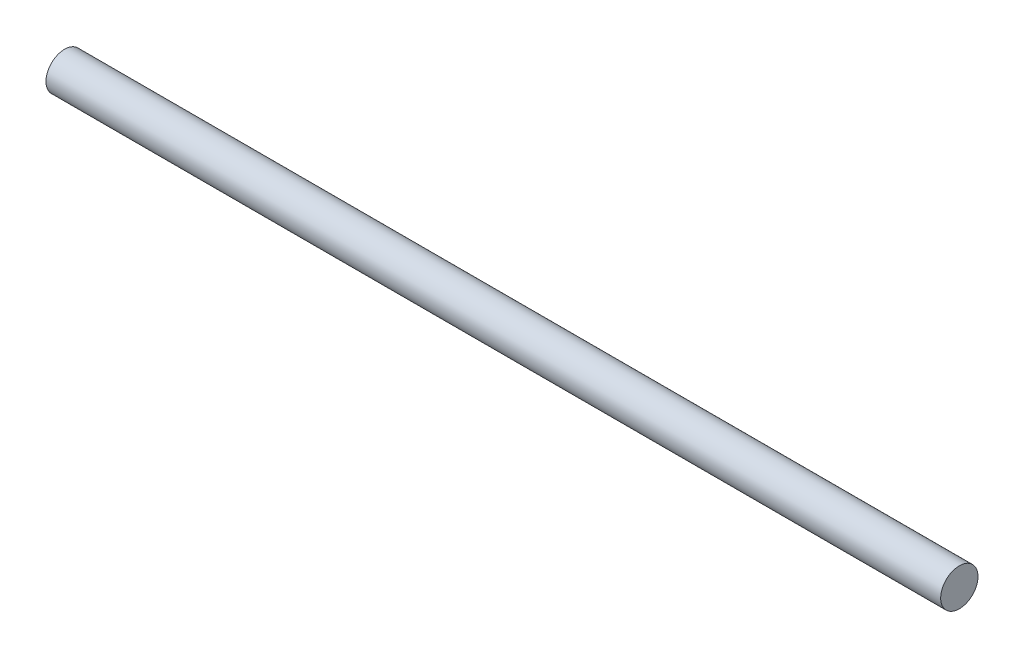
ISO-10303-21;
HEADER;
FILE_DESCRIPTION(('STEP AP214'),'2;1');
FILE_NAME('part.step','',(''),(''),'','','');
FILE_SCHEMA(('AUTOMOTIVE_DESIGN { 1 0 10303 214 1 1 1 1 }'));
ENDSEC;
DATA;
#1=APPLICATION_CONTEXT('core data for automotive mechanical design processes');
#2=APPLICATION_PROTOCOL_DEFINITION('international standard','automotive_design',2000,#1);
#3=PRODUCT_CONTEXT('',#1,'mechanical');
#4=PRODUCT('Part','Part','',(#3));
#5=PRODUCT_RELATED_PRODUCT_CATEGORY('part','',(#4));
#6=PRODUCT_DEFINITION_FORMATION('','',#4);
#7=PRODUCT_DEFINITION_CONTEXT('part definition',#1,'design');
#8=PRODUCT_DEFINITION('design','',#6,#7);
#9=PRODUCT_DEFINITION_SHAPE('','',#8);
#10=(LENGTH_UNIT() NAMED_UNIT(*) SI_UNIT(.MILLI.,.METRE.));
#11=(NAMED_UNIT(*) PLANE_ANGLE_UNIT() SI_UNIT($,.RADIAN.));
#12=(NAMED_UNIT(*) SI_UNIT($,.STERADIAN.) SOLID_ANGLE_UNIT());
#13=UNCERTAINTY_MEASURE_WITH_UNIT(LENGTH_MEASURE(1.E-05),#10,'distance_accuracy_value','');
#14=(GEOMETRIC_REPRESENTATION_CONTEXT(3) GLOBAL_UNCERTAINTY_ASSIGNED_CONTEXT((#13)) GLOBAL_UNIT_ASSIGNED_CONTEXT((#10,
#11,#12)) REPRESENTATION_CONTEXT('',''));
#15=CARTESIAN_POINT('',(0.,0.,0.));
#16=DIRECTION('',(0.,0.,1.));
#17=DIRECTION('',(1.,0.,0.));
#18=AXIS2_PLACEMENT_3D('',#15,#16,#17);
#19=CARTESIAN_POINT('',(456.55,0.,0.));
#20=DIRECTION('',(-1.,0.,0.));
#21=DIRECTION('',(0.,0.,1.));
#22=AXIS2_PLACEMENT_3D('',#19,#20,#21);
#23=CYLINDRICAL_SURFACE('',#22,19.05);
#24=CARTESIAN_POINT('',(456.55,0.,0.));
#25=DIRECTION('',(1.,0.,0.));
#26=DIRECTION('',(0.,0.,-1.));
#27=AXIS2_PLACEMENT_3D('',#24,#25,#26);
#28=CIRCLE('',#27,19.05);
#29=CARTESIAN_POINT('',(456.55,0.,-19.05));
#30=VERTEX_POINT('',#29);
#31=EDGE_CURVE('E10',#30,#30,#28,.T.);
#32=ORIENTED_EDGE('',*,*,#31,.F.);
#33=EDGE_LOOP('',(#32));
#34=FACE_BOUND('',#33,.T.);
#35=CARTESIAN_POINT('',(-456.55,0.,0.));
#36=DIRECTION('',(1.,0.,0.));
#37=DIRECTION('',(0.,0.,-1.));
#38=AXIS2_PLACEMENT_3D('',#35,#36,#37);
#39=CIRCLE('',#38,19.05);
#40=CARTESIAN_POINT('',(-456.55,0.,-19.05));
#41=VERTEX_POINT('',#40);
#42=EDGE_CURVE('E40',#41,#41,#39,.T.);
#43=ORIENTED_EDGE('',*,*,#42,.T.);
#44=EDGE_LOOP('',(#43));
#45=FACE_BOUND('',#44,.T.);
#46=ADVANCED_FACE('F37',(#34,#45),#23,.T.);
#47=CARTESIAN_POINT('',(456.55,0.,0.));
#48=DIRECTION('',(1.,0.,0.));
#49=DIRECTION('',(0.,0.,-1.));
#50=AXIS2_PLACEMENT_3D('',#47,#48,#49);
#51=PLANE('',#50);
#52=ORIENTED_EDGE('',*,*,#31,.T.);
#53=EDGE_LOOP('',(#52));
#54=FACE_BOUND('',#53,.T.);
#55=ADVANCED_FACE('F54',(#54),#51,.T.);
#56=CARTESIAN_POINT('',(-456.55,0.,0.));
#57=DIRECTION('',(1.,0.,0.));
#58=DIRECTION('',(0.,0.,-1.));
#59=AXIS2_PLACEMENT_3D('',#56,#57,#58);
#60=PLANE('',#59);
#61=ORIENTED_EDGE('',*,*,#42,.F.);
#62=EDGE_LOOP('',(#61));
#63=FACE_BOUND('',#62,.T.);
#64=ADVANCED_FACE('F52',(#63),#60,.F.);
#65=CLOSED_SHELL('',(#46,#55,#64));
#66=MANIFOLD_SOLID_BREP('B2',#65);
#67=ADVANCED_BREP_SHAPE_REPRESENTATION('',(#18,#66),#14);
#68=SHAPE_DEFINITION_REPRESENTATION(#9,#67);
ENDSEC;
END-ISO-10303-21;
